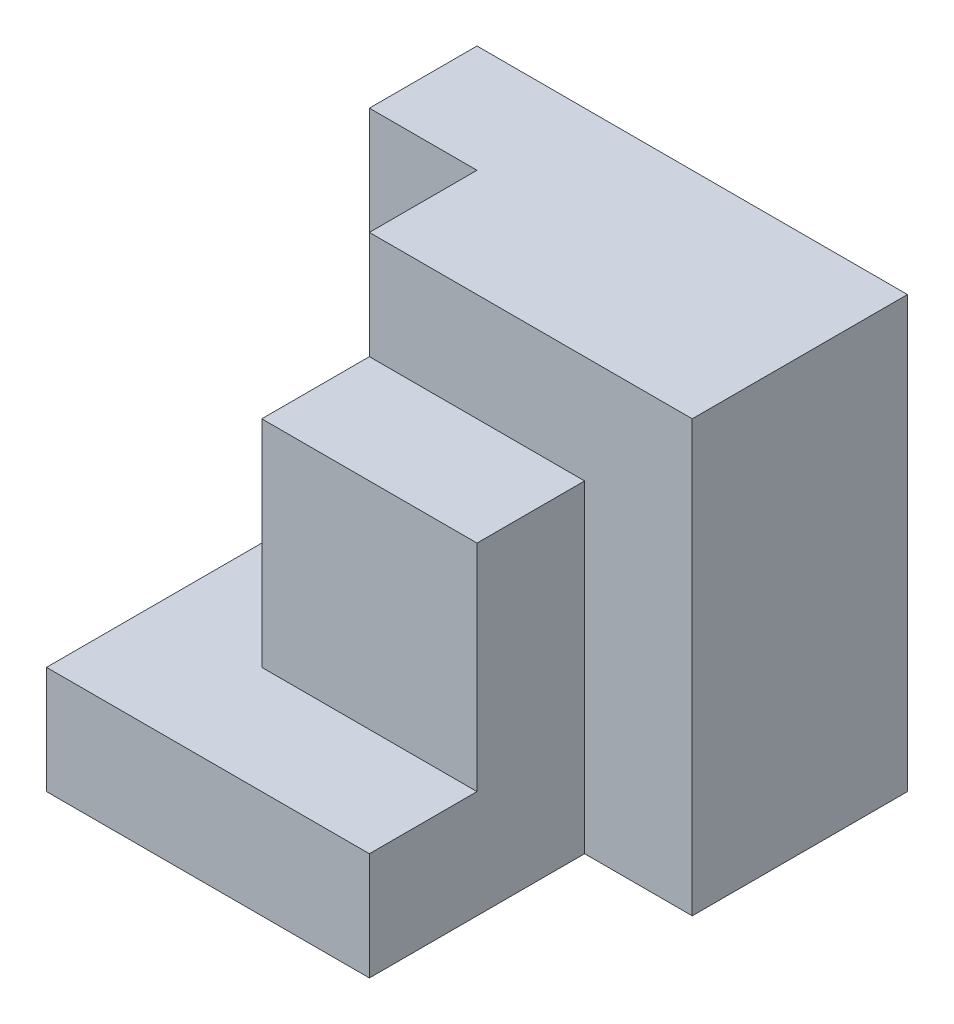
ISO-10303-21;
HEADER;
FILE_DESCRIPTION(('STEP AP214'),'2;1');
FILE_NAME('part.step','',(''),(''),'','','');
FILE_SCHEMA(('AUTOMOTIVE_DESIGN { 1 0 10303 214 1 1 1 1 }'));
ENDSEC;
DATA;
#1=APPLICATION_CONTEXT('core data for automotive mechanical design processes');
#2=APPLICATION_PROTOCOL_DEFINITION('international standard','automotive_design',2000,#1);
#3=PRODUCT_CONTEXT('',#1,'mechanical');
#4=PRODUCT('Part','Part','',(#3));
#5=PRODUCT_RELATED_PRODUCT_CATEGORY('part','',(#4));
#6=PRODUCT_DEFINITION_FORMATION('','',#4);
#7=PRODUCT_DEFINITION_CONTEXT('part definition',#1,'design');
#8=PRODUCT_DEFINITION('design','',#6,#7);
#9=PRODUCT_DEFINITION_SHAPE('','',#8);
#10=(LENGTH_UNIT() NAMED_UNIT(*) SI_UNIT(.MILLI.,.METRE.));
#11=(NAMED_UNIT(*) PLANE_ANGLE_UNIT() SI_UNIT($,.RADIAN.));
#12=(NAMED_UNIT(*) SI_UNIT($,.STERADIAN.) SOLID_ANGLE_UNIT());
#13=UNCERTAINTY_MEASURE_WITH_UNIT(LENGTH_MEASURE(1.E-05),#10,'distance_accuracy_value','');
#14=(GEOMETRIC_REPRESENTATION_CONTEXT(3) GLOBAL_UNCERTAINTY_ASSIGNED_CONTEXT((#13)) GLOBAL_UNIT_ASSIGNED_CONTEXT((#10,
#11,#12)) REPRESENTATION_CONTEXT('',''));
#15=CARTESIAN_POINT('',(0.,0.,0.));
#16=DIRECTION('',(0.,0.,1.));
#17=DIRECTION('',(1.,0.,0.));
#18=AXIS2_PLACEMENT_3D('',#15,#16,#17);
#19=CARTESIAN_POINT('',(0.,0.,40.));
#20=DIRECTION('',(1.,0.,0.));
#21=DIRECTION('',(0.,0.,-1.));
#22=AXIS2_PLACEMENT_3D('',#19,#20,#21);
#23=PLANE('',#22);
#24=DIRECTION('',(0.,0.,-1.));
#25=VECTOR('',#24,1.);
#26=CARTESIAN_POINT('',(0.,9.99999999999999,0.));
#27=LINE('',#26,#25);
#28=CARTESIAN_POINT('',(0.,10.,40.));
#29=VERTEX_POINT('',#28);
#30=CARTESIAN_POINT('',(0.,10.,10.));
#31=VERTEX_POINT('',#30);
#32=EDGE_CURVE('E146',#29,#31,#27,.T.);
#33=ORIENTED_EDGE('',*,*,#32,.T.);
#34=DIRECTION('',(0.,1.,0.));
#35=VECTOR('',#34,1.);
#36=CARTESIAN_POINT('',(0.,10.,10.));
#37=LINE('',#36,#35);
#38=CARTESIAN_POINT('',(0.,40.,10.));
#39=VERTEX_POINT('',#38);
#40=EDGE_CURVE('E131',#31,#39,#37,.T.);
#41=ORIENTED_EDGE('',*,*,#40,.T.);
#42=DIRECTION('',(0.,0.,-1.));
#43=VECTOR('',#42,1.);
#44=CARTESIAN_POINT('',(0.,40.,40.));
#45=LINE('',#44,#43);
#46=CARTESIAN_POINT('',(0.,40.,0.));
#47=VERTEX_POINT('',#46);
#48=EDGE_CURVE('E182',#39,#47,#45,.T.);
#49=ORIENTED_EDGE('',*,*,#48,.T.);
#50=DIRECTION('',(0.,-1.,0.));
#51=VECTOR('',#50,1.);
#52=CARTESIAN_POINT('',(0.,0.,0.));
#53=LINE('',#52,#51);
#54=CARTESIAN_POINT('',(0.,0.,0.));
#55=VERTEX_POINT('',#54);
#56=EDGE_CURVE('E171',#47,#55,#53,.T.);
#57=ORIENTED_EDGE('',*,*,#56,.T.);
#58=DIRECTION('',(0.,0.,-1.));
#59=VECTOR('',#58,1.);
#60=CARTESIAN_POINT('',(0.,0.,40.));
#61=LINE('',#60,#59);
#62=CARTESIAN_POINT('',(0.,0.,40.));
#63=VERTEX_POINT('',#62);
#64=EDGE_CURVE('E198',#63,#55,#61,.T.);
#65=ORIENTED_EDGE('',*,*,#64,.F.);
#66=DIRECTION('',(0.,-1.,0.));
#67=VECTOR('',#66,1.);
#68=CARTESIAN_POINT('',(0.,0.,40.));
#69=LINE('',#68,#67);
#70=EDGE_CURVE('E176',#29,#63,#69,.T.);
#71=ORIENTED_EDGE('',*,*,#70,.F.);
#72=EDGE_LOOP('',(#33,#41,#49,#57,#65,#71));
#73=FACE_BOUND('',#72,.T.);
#74=ADVANCED_FACE('F33',(#73),#23,.F.);
#75=CARTESIAN_POINT('',(0.,0.,40.));
#76=DIRECTION('',(0.,0.,-1.));
#77=DIRECTION('',(-1.,0.,0.));
#78=AXIS2_PLACEMENT_3D('',#75,#76,#77);
#79=PLANE('',#78);
#80=DIRECTION('',(-1.,0.,0.));
#81=VECTOR('',#80,1.);
#82=CARTESIAN_POINT('',(40.,10.,40.));
#83=LINE('',#82,#81);
#84=CARTESIAN_POINT('',(30.,10.,40.));
#85=VERTEX_POINT('',#84);
#86=EDGE_CURVE('E148',#85,#29,#83,.T.);
#87=ORIENTED_EDGE('',*,*,#86,.T.);
#88=ORIENTED_EDGE('',*,*,#70,.T.);
#89=DIRECTION('',(1.,0.,0.));
#90=VECTOR('',#89,1.);
#91=CARTESIAN_POINT('',(0.,0.,40.));
#92=LINE('',#91,#90);
#93=CARTESIAN_POINT('',(30.,0.,40.));
#94=VERTEX_POINT('',#93);
#95=EDGE_CURVE('E178',#63,#94,#92,.T.);
#96=ORIENTED_EDGE('',*,*,#95,.T.);
#97=DIRECTION('',(0.,1.,0.));
#98=VECTOR('',#97,1.);
#99=CARTESIAN_POINT('',(30.,0.,40.));
#100=LINE('',#99,#98);
#101=EDGE_CURVE('E168',#94,#85,#100,.T.);
#102=ORIENTED_EDGE('',*,*,#101,.T.);
#103=EDGE_LOOP('',(#87,#88,#96,#102));
#104=FACE_BOUND('',#103,.T.);
#105=ADVANCED_FACE('F232',(#104),#79,.F.);
#106=CARTESIAN_POINT('',(30.,0.,40.));
#107=DIRECTION('',(-1.,0.,0.));
#108=DIRECTION('',(0.,0.,1.));
#109=AXIS2_PLACEMENT_3D('',#106,#107,#108);
#110=PLANE('',#109);
#111=DIRECTION('',(0.,0.,-1.));
#112=VECTOR('',#111,1.);
#113=CARTESIAN_POINT('',(30.,10.,40.));
#114=LINE('',#113,#112);
#115=CARTESIAN_POINT('',(30.,10.,30.));
#116=VERTEX_POINT('',#115);
#117=EDGE_CURVE('E11',#85,#116,#114,.T.);
#118=ORIENTED_EDGE('',*,*,#117,.F.);
#119=ORIENTED_EDGE('',*,*,#101,.F.);
#120=DIRECTION('',(0.,0.,1.));
#121=VECTOR('',#120,1.);
#122=CARTESIAN_POINT('',(30.,0.,40.));
#123=LINE('',#122,#121);
#124=CARTESIAN_POINT('',(30.,0.,20.));
#125=VERTEX_POINT('',#124);
#126=EDGE_CURVE('E162',#125,#94,#123,.T.);
#127=ORIENTED_EDGE('',*,*,#126,.F.);
#128=DIRECTION('',(0.,1.,0.));
#129=VECTOR('',#128,1.);
#130=CARTESIAN_POINT('',(30.,0.,20.));
#131=LINE('',#130,#129);
#132=CARTESIAN_POINT('',(30.,30.,20.));
#133=VERTEX_POINT('',#132);
#134=EDGE_CURVE('E172',#125,#133,#131,.T.);
#135=ORIENTED_EDGE('',*,*,#134,.T.);
#136=DIRECTION('',(0.,0.,-1.));
#137=VECTOR('',#136,1.);
#138=CARTESIAN_POINT('',(30.,30.,40.));
#139=LINE('',#138,#137);
#140=CARTESIAN_POINT('',(30.,30.,30.));
#141=VERTEX_POINT('',#140);
#142=EDGE_CURVE('E151',#141,#133,#139,.T.);
#143=ORIENTED_EDGE('',*,*,#142,.F.);
#144=DIRECTION('',(0.,-1.,0.));
#145=VECTOR('',#144,1.);
#146=CARTESIAN_POINT('',(30.,0.,30.));
#147=LINE('',#146,#145);
#148=EDGE_CURVE('E40',#141,#116,#147,.T.);
#149=ORIENTED_EDGE('',*,*,#148,.T.);
#150=EDGE_LOOP('',(#118,#119,#127,#135,#143,#149));
#151=FACE_BOUND('',#150,.T.);
#152=ADVANCED_FACE('F204',(#151),#110,.F.);
#153=CARTESIAN_POINT('',(0.,0.,40.));
#154=DIRECTION('',(0.,1.,0.));
#155=DIRECTION('',(0.,0.,1.));
#156=AXIS2_PLACEMENT_3D('',#153,#154,#155);
#157=PLANE('',#156);
#158=DIRECTION('',(-1.,0.,0.));
#159=VECTOR('',#158,1.);
#160=CARTESIAN_POINT('',(40.,0.,20.));
#161=LINE('',#160,#159);
#162=CARTESIAN_POINT('',(40.,0.,20.));
#163=VERTEX_POINT('',#162);
#164=EDGE_CURVE('E159',#163,#125,#161,.T.);
#165=ORIENTED_EDGE('',*,*,#164,.T.);
#166=ORIENTED_EDGE('',*,*,#126,.T.);
#167=ORIENTED_EDGE('',*,*,#95,.F.);
#168=ORIENTED_EDGE('',*,*,#64,.T.);
#169=DIRECTION('',(1.,0.,0.));
#170=VECTOR('',#169,1.);
#171=CARTESIAN_POINT('',(0.,0.,0.));
#172=LINE('',#171,#170);
#173=CARTESIAN_POINT('',(40.,0.,0.));
#174=VERTEX_POINT('',#173);
#175=EDGE_CURVE('E185',#55,#174,#172,.T.);
#176=ORIENTED_EDGE('',*,*,#175,.T.);
#177=DIRECTION('',(0.,0.,-1.));
#178=VECTOR('',#177,1.);
#179=CARTESIAN_POINT('',(40.,0.,40.));
#180=LINE('',#179,#178);
#181=EDGE_CURVE('E196',#163,#174,#180,.T.);
#182=ORIENTED_EDGE('',*,*,#181,.F.);
#183=EDGE_LOOP('',(#165,#166,#167,#168,#176,#182));
#184=FACE_BOUND('',#183,.T.);
#185=ADVANCED_FACE('F221',(#184),#157,.F.);
#186=CARTESIAN_POINT('',(40.,0.,40.));
#187=DIRECTION('',(-1.,0.,0.));
#188=DIRECTION('',(0.,0.,1.));
#189=AXIS2_PLACEMENT_3D('',#186,#187,#188);
#190=PLANE('',#189);
#191=DIRECTION('',(0.,0.,-1.));
#192=VECTOR('',#191,1.);
#193=CARTESIAN_POINT('',(40.,40.,40.));
#194=LINE('',#193,#192);
#195=CARTESIAN_POINT('',(40.,40.,20.));
#196=VERTEX_POINT('',#195);
#197=CARTESIAN_POINT('',(40.,40.,0.));
#198=VERTEX_POINT('',#197);
#199=EDGE_CURVE('E194',#196,#198,#194,.T.);
#200=ORIENTED_EDGE('',*,*,#199,.F.);
#201=DIRECTION('',(0.,1.,0.));
#202=VECTOR('',#201,1.);
#203=CARTESIAN_POINT('',(40.,0.,20.));
#204=LINE('',#203,#202);
#205=EDGE_CURVE('E165',#163,#196,#204,.T.);
#206=ORIENTED_EDGE('',*,*,#205,.F.);
#207=ORIENTED_EDGE('',*,*,#181,.T.);
#208=DIRECTION('',(0.,1.,0.));
#209=VECTOR('',#208,1.);
#210=CARTESIAN_POINT('',(40.,0.,0.));
#211=LINE('',#210,#209);
#212=EDGE_CURVE('E188',#174,#198,#211,.T.);
#213=ORIENTED_EDGE('',*,*,#212,.T.);
#214=EDGE_LOOP('',(#200,#206,#207,#213));
#215=FACE_BOUND('',#214,.T.);
#216=ADVANCED_FACE('F219',(#215),#190,.F.);
#217=CARTESIAN_POINT('',(0.,40.,40.));
#218=DIRECTION('',(0.,-1.,0.));
#219=DIRECTION('',(0.,0.,-1.));
#220=AXIS2_PLACEMENT_3D('',#217,#218,#219);
#221=PLANE('',#220);
#222=ORIENTED_EDGE('',*,*,#48,.F.);
#223=DIRECTION('',(-1.,0.,0.));
#224=VECTOR('',#223,1.);
#225=CARTESIAN_POINT('',(0.,40.,10.));
#226=LINE('',#225,#224);
#227=CARTESIAN_POINT('',(10.,40.,10.));
#228=VERTEX_POINT('',#227);
#229=EDGE_CURVE('E137',#228,#39,#226,.T.);
#230=ORIENTED_EDGE('',*,*,#229,.F.);
#231=DIRECTION('',(0.,0.,-1.));
#232=VECTOR('',#231,1.);
#233=CARTESIAN_POINT('',(10.,40.,20.));
#234=LINE('',#233,#232);
#235=CARTESIAN_POINT('',(10.,40.,20.));
#236=VERTEX_POINT('',#235);
#237=EDGE_CURVE('E128',#236,#228,#234,.T.);
#238=ORIENTED_EDGE('',*,*,#237,.F.);
#239=DIRECTION('',(-1.,0.,0.));
#240=VECTOR('',#239,1.);
#241=CARTESIAN_POINT('',(40.,40.,20.));
#242=LINE('',#241,#240);
#243=EDGE_CURVE('E158',#196,#236,#242,.T.);
#244=ORIENTED_EDGE('',*,*,#243,.F.);
#245=ORIENTED_EDGE('',*,*,#199,.T.);
#246=DIRECTION('',(-1.,0.,0.));
#247=VECTOR('',#246,1.);
#248=CARTESIAN_POINT('',(0.,40.,0.));
#249=LINE('',#248,#247);
#250=EDGE_CURVE('E179',#198,#47,#249,.T.);
#251=ORIENTED_EDGE('',*,*,#250,.T.);
#252=EDGE_LOOP('',(#222,#230,#238,#244,#245,#251));
#253=FACE_BOUND('',#252,.T.);
#254=ADVANCED_FACE('F213',(#253),#221,.F.);
#255=CARTESIAN_POINT('',(0.,0.,0.));
#256=DIRECTION('',(0.,0.,-1.));
#257=DIRECTION('',(-1.,0.,0.));
#258=AXIS2_PLACEMENT_3D('',#255,#256,#257);
#259=PLANE('',#258);
#260=ORIENTED_EDGE('',*,*,#56,.F.);
#261=ORIENTED_EDGE('',*,*,#250,.F.);
#262=ORIENTED_EDGE('',*,*,#212,.F.);
#263=ORIENTED_EDGE('',*,*,#175,.F.);
#264=EDGE_LOOP('',(#260,#261,#262,#263));
#265=FACE_BOUND('',#264,.T.);
#266=ADVANCED_FACE('F228',(#265),#259,.T.);
#267=CARTESIAN_POINT('',(40.,0.,20.));
#268=DIRECTION('',(0.,0.,-1.));
#269=DIRECTION('',(-1.,0.,0.));
#270=AXIS2_PLACEMENT_3D('',#267,#268,#269);
#271=PLANE('',#270);
#272=ORIENTED_EDGE('',*,*,#243,.T.);
#273=DIRECTION('',(0.,1.,0.));
#274=VECTOR('',#273,1.);
#275=CARTESIAN_POINT('',(10.,10.,20.));
#276=LINE('',#275,#274);
#277=CARTESIAN_POINT('',(10.,30.,20.));
#278=VERTEX_POINT('',#277);
#279=EDGE_CURVE('E132',#278,#236,#276,.T.);
#280=ORIENTED_EDGE('',*,*,#279,.F.);
#281=DIRECTION('',(-1.,0.,0.));
#282=VECTOR('',#281,1.);
#283=CARTESIAN_POINT('',(40.,30.,20.));
#284=LINE('',#283,#282);
#285=EDGE_CURVE('E55',#133,#278,#284,.T.);
#286=ORIENTED_EDGE('',*,*,#285,.F.);
#287=ORIENTED_EDGE('',*,*,#134,.F.);
#288=ORIENTED_EDGE('',*,*,#164,.F.);
#289=ORIENTED_EDGE('',*,*,#205,.T.);
#290=EDGE_LOOP('',(#272,#280,#286,#287,#288,#289));
#291=FACE_BOUND('',#290,.T.);
#292=ADVANCED_FACE('F215',(#291),#271,.F.);
#293=CARTESIAN_POINT('',(40.,9.99999999999999,0.));
#294=DIRECTION('',(0.,1.,0.));
#295=DIRECTION('',(0.,0.,1.));
#296=AXIS2_PLACEMENT_3D('',#293,#294,#295);
#297=PLANE('',#296);
#298=ORIENTED_EDGE('',*,*,#117,.T.);
#299=DIRECTION('',(-1.,0.,0.));
#300=VECTOR('',#299,1.);
#301=CARTESIAN_POINT('',(40.,10.,30.));
#302=LINE('',#301,#300);
#303=CARTESIAN_POINT('',(10.,9.99999999999998,30.));
#304=VERTEX_POINT('',#303);
#305=EDGE_CURVE('E121',#116,#304,#302,.T.);
#306=ORIENTED_EDGE('',*,*,#305,.T.);
#307=DIRECTION('',(0.,0.,-1.));
#308=VECTOR('',#307,1.);
#309=CARTESIAN_POINT('',(10.,9.99999999999998,20.));
#310=LINE('',#309,#308);
#311=CARTESIAN_POINT('',(10.,10.,10.));
#312=VERTEX_POINT('',#311);
#313=EDGE_CURVE('E115',#304,#312,#310,.T.);
#314=ORIENTED_EDGE('',*,*,#313,.T.);
#315=DIRECTION('',(-1.,0.,0.));
#316=VECTOR('',#315,1.);
#317=CARTESIAN_POINT('',(0.,10.,10.));
#318=LINE('',#317,#316);
#319=EDGE_CURVE('E119',#312,#31,#318,.T.);
#320=ORIENTED_EDGE('',*,*,#319,.T.);
#321=ORIENTED_EDGE('',*,*,#32,.F.);
#322=ORIENTED_EDGE('',*,*,#86,.F.);
#323=EDGE_LOOP('',(#298,#306,#314,#320,#321,#322));
#324=FACE_BOUND('',#323,.T.);
#325=ADVANCED_FACE('F117',(#324),#297,.T.);
#326=CARTESIAN_POINT('',(40.,0.,30.));
#327=DIRECTION('',(0.,0.,-1.));
#328=DIRECTION('',(0.,1.,0.));
#329=AXIS2_PLACEMENT_3D('',#326,#327,#328);
#330=PLANE('',#329);
#331=DIRECTION('',(-1.,0.,0.));
#332=VECTOR('',#331,1.);
#333=CARTESIAN_POINT('',(40.,30.,30.));
#334=LINE('',#333,#332);
#335=CARTESIAN_POINT('',(10.,30.,30.));
#336=VERTEX_POINT('',#335);
#337=EDGE_CURVE('E153',#141,#336,#334,.T.);
#338=ORIENTED_EDGE('',*,*,#337,.T.);
#339=DIRECTION('',(0.,1.,0.));
#340=VECTOR('',#339,1.);
#341=CARTESIAN_POINT('',(10.,9.99999999999998,30.));
#342=LINE('',#341,#340);
#343=EDGE_CURVE('E47',#304,#336,#342,.T.);
#344=ORIENTED_EDGE('',*,*,#343,.F.);
#345=ORIENTED_EDGE('',*,*,#305,.F.);
#346=ORIENTED_EDGE('',*,*,#148,.F.);
#347=EDGE_LOOP('',(#338,#344,#345,#346));
#348=FACE_BOUND('',#347,.T.);
#349=ADVANCED_FACE('F207',(#348),#330,.F.);
#350=CARTESIAN_POINT('',(40.,30.,0.));
#351=DIRECTION('',(0.,1.,0.));
#352=DIRECTION('',(0.,0.,1.));
#353=AXIS2_PLACEMENT_3D('',#350,#351,#352);
#354=PLANE('',#353);
#355=DIRECTION('',(0.,0.,-1.));
#356=VECTOR('',#355,1.);
#357=CARTESIAN_POINT('',(10.,30.,20.));
#358=LINE('',#357,#356);
#359=EDGE_CURVE('E122',#336,#278,#358,.T.);
#360=ORIENTED_EDGE('',*,*,#359,.F.);
#361=ORIENTED_EDGE('',*,*,#337,.F.);
#362=ORIENTED_EDGE('',*,*,#142,.T.);
#363=ORIENTED_EDGE('',*,*,#285,.T.);
#364=EDGE_LOOP('',(#360,#361,#362,#363));
#365=FACE_BOUND('',#364,.T.);
#366=ADVANCED_FACE('F209',(#365),#354,.T.);
#367=CARTESIAN_POINT('',(10.,9.99999999999998,20.));
#368=DIRECTION('',(1.,0.,0.));
#369=DIRECTION('',(0.,0.,-1.));
#370=AXIS2_PLACEMENT_3D('',#367,#368,#369);
#371=PLANE('',#370);
#372=ORIENTED_EDGE('',*,*,#359,.T.);
#373=ORIENTED_EDGE('',*,*,#279,.T.);
#374=ORIENTED_EDGE('',*,*,#237,.T.);
#375=DIRECTION('',(0.,1.,0.));
#376=VECTOR('',#375,1.);
#377=CARTESIAN_POINT('',(10.,10.,10.));
#378=LINE('',#377,#376);
#379=EDGE_CURVE('E125',#312,#228,#378,.T.);
#380=ORIENTED_EDGE('',*,*,#379,.F.);
#381=ORIENTED_EDGE('',*,*,#313,.F.);
#382=ORIENTED_EDGE('',*,*,#343,.T.);
#383=EDGE_LOOP('',(#372,#373,#374,#380,#381,#382));
#384=FACE_BOUND('',#383,.T.);
#385=ADVANCED_FACE('F126',(#384),#371,.F.);
#386=CARTESIAN_POINT('',(0.,10.,10.));
#387=DIRECTION('',(0.,0.,-1.));
#388=DIRECTION('',(-1.,0.,0.));
#389=AXIS2_PLACEMENT_3D('',#386,#387,#388);
#390=PLANE('',#389);
#391=ORIENTED_EDGE('',*,*,#229,.T.);
#392=ORIENTED_EDGE('',*,*,#40,.F.);
#393=ORIENTED_EDGE('',*,*,#319,.F.);
#394=ORIENTED_EDGE('',*,*,#379,.T.);
#395=EDGE_LOOP('',(#391,#392,#393,#394));
#396=FACE_BOUND('',#395,.T.);
#397=ADVANCED_FACE('F135',(#396),#390,.F.);
#398=CLOSED_SHELL('',(#74,#105,#152,#185,#216,#254,#266,#292,#325,#349,#366,#385,#397));
#399=MANIFOLD_SOLID_BREP('B2',#398);
#400=ADVANCED_BREP_SHAPE_REPRESENTATION('',(#18,#399),#14);
#401=SHAPE_DEFINITION_REPRESENTATION(#9,#400);
ENDSEC;
END-ISO-10303-21;
